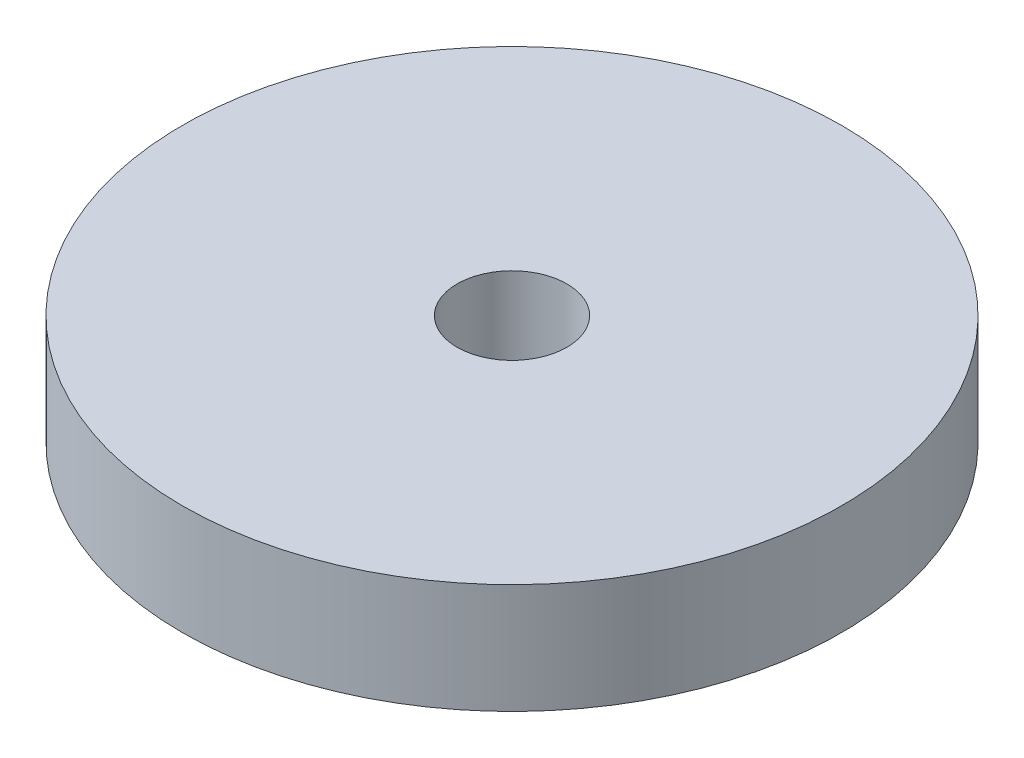
ISO-10303-21;
HEADER;
FILE_DESCRIPTION(('STEP AP214'),'2;1');
FILE_NAME('part.step','',(''),(''),'','','');
FILE_SCHEMA(('AUTOMOTIVE_DESIGN { 1 0 10303 214 1 1 1 1 }'));
ENDSEC;
DATA;
#1=APPLICATION_CONTEXT('core data for automotive mechanical design processes');
#2=APPLICATION_PROTOCOL_DEFINITION('international standard','automotive_design',2000,#1);
#3=PRODUCT_CONTEXT('',#1,'mechanical');
#4=PRODUCT('Part','Part','',(#3));
#5=PRODUCT_RELATED_PRODUCT_CATEGORY('part','',(#4));
#6=PRODUCT_DEFINITION_FORMATION('','',#4);
#7=PRODUCT_DEFINITION_CONTEXT('part definition',#1,'design');
#8=PRODUCT_DEFINITION('design','',#6,#7);
#9=PRODUCT_DEFINITION_SHAPE('','',#8);
#10=(LENGTH_UNIT() NAMED_UNIT(*) SI_UNIT(.MILLI.,.METRE.));
#11=(NAMED_UNIT(*) PLANE_ANGLE_UNIT() SI_UNIT($,.RADIAN.));
#12=(NAMED_UNIT(*) SI_UNIT($,.STERADIAN.) SOLID_ANGLE_UNIT());
#13=UNCERTAINTY_MEASURE_WITH_UNIT(LENGTH_MEASURE(1.E-05),#10,'distance_accuracy_value','');
#14=(GEOMETRIC_REPRESENTATION_CONTEXT(3) GLOBAL_UNCERTAINTY_ASSIGNED_CONTEXT((#13)) GLOBAL_UNIT_ASSIGNED_CONTEXT((#10,
#11,#12)) REPRESENTATION_CONTEXT('',''));
#15=CARTESIAN_POINT('',(0.,0.,0.));
#16=DIRECTION('',(0.,0.,1.));
#17=DIRECTION('',(1.,0.,0.));
#18=AXIS2_PLACEMENT_3D('',#15,#16,#17);
#19=CARTESIAN_POINT('',(0.,-25.,0.));
#20=DIRECTION('',(0.,1.,0.));
#21=DIRECTION('',(0.,0.,1.));
#22=AXIS2_PLACEMENT_3D('',#19,#20,#21);
#23=CYLINDRICAL_SURFACE('',#22,150.);
#24=CARTESIAN_POINT('',(0.,-25.,0.));
#25=DIRECTION('',(0.,1.,0.));
#26=DIRECTION('',(0.,0.,1.));
#27=AXIS2_PLACEMENT_3D('',#24,#25,#26);
#28=CIRCLE('',#27,150.);
#29=CARTESIAN_POINT('',(0.,-25.,150.));
#30=VERTEX_POINT('',#29);
#31=EDGE_CURVE('E10',#30,#30,#28,.T.);
#32=ORIENTED_EDGE('',*,*,#31,.T.);
#33=EDGE_LOOP('',(#32));
#34=FACE_BOUND('',#33,.T.);
#35=CARTESIAN_POINT('',(0.,25.,0.));
#36=DIRECTION('',(0.,1.,0.));
#37=DIRECTION('',(0.,0.,1.));
#38=AXIS2_PLACEMENT_3D('',#35,#36,#37);
#39=CIRCLE('',#38,150.);
#40=CARTESIAN_POINT('',(0.,25.,150.));
#41=VERTEX_POINT('',#40);
#42=EDGE_CURVE('E38',#41,#41,#39,.T.);
#43=ORIENTED_EDGE('',*,*,#42,.F.);
#44=EDGE_LOOP('',(#43));
#45=FACE_BOUND('',#44,.T.);
#46=ADVANCED_FACE('F32',(#34,#45),#23,.T.);
#47=CARTESIAN_POINT('',(0.,-25.,0.));
#48=DIRECTION('',(0.,1.,0.));
#49=DIRECTION('',(0.,0.,1.));
#50=AXIS2_PLACEMENT_3D('',#47,#48,#49);
#51=PLANE('',#50);
#52=CARTESIAN_POINT('',(0.,-25.,0.));
#53=DIRECTION('',(0.,1.,0.));
#54=DIRECTION('',(0.,0.,1.));
#55=AXIS2_PLACEMENT_3D('',#52,#53,#54);
#56=CIRCLE('',#55,25.);
#57=CARTESIAN_POINT('',(0.,-25.,25.));
#58=VERTEX_POINT('',#57);
#59=EDGE_CURVE('E42',#58,#58,#56,.T.);
#60=ORIENTED_EDGE('',*,*,#59,.T.);
#61=EDGE_LOOP('',(#60));
#62=FACE_BOUND('',#61,.T.);
#63=ORIENTED_EDGE('',*,*,#31,.F.);
#64=EDGE_LOOP('',(#63));
#65=FACE_BOUND('',#64,.T.);
#66=ADVANCED_FACE('F56',(#62,#65),#51,.F.);
#67=CARTESIAN_POINT('',(0.,25.,0.));
#68=DIRECTION('',(0.,1.,0.));
#69=DIRECTION('',(0.,0.,1.));
#70=AXIS2_PLACEMENT_3D('',#67,#68,#69);
#71=PLANE('',#70);
#72=CARTESIAN_POINT('',(0.,25.,0.));
#73=DIRECTION('',(0.,1.,0.));
#74=DIRECTION('',(0.,0.,1.));
#75=AXIS2_PLACEMENT_3D('',#72,#73,#74);
#76=CIRCLE('',#75,25.);
#77=CARTESIAN_POINT('',(0.,25.,25.));
#78=VERTEX_POINT('',#77);
#79=EDGE_CURVE('E46',#78,#78,#76,.T.);
#80=ORIENTED_EDGE('',*,*,#79,.F.);
#81=EDGE_LOOP('',(#80));
#82=FACE_BOUND('',#81,.T.);
#83=ORIENTED_EDGE('',*,*,#42,.T.);
#84=EDGE_LOOP('',(#83));
#85=FACE_BOUND('',#84,.T.);
#86=ADVANCED_FACE('F54',(#82,#85),#71,.T.);
#87=CARTESIAN_POINT('',(0.,-25.,0.));
#88=DIRECTION('',(0.,1.,0.));
#89=DIRECTION('',(0.,0.,1.));
#90=AXIS2_PLACEMENT_3D('',#87,#88,#89);
#91=CYLINDRICAL_SURFACE('',#90,25.);
#92=ORIENTED_EDGE('',*,*,#59,.F.);
#93=EDGE_LOOP('',(#92));
#94=FACE_BOUND('',#93,.T.);
#95=ORIENTED_EDGE('',*,*,#79,.T.);
#96=EDGE_LOOP('',(#95));
#97=FACE_BOUND('',#96,.T.);
#98=ADVANCED_FACE('F52',(#94,#97),#91,.F.);
#99=CLOSED_SHELL('',(#46,#66,#86,#98));
#100=MANIFOLD_SOLID_BREP('B2',#99);
#101=ADVANCED_BREP_SHAPE_REPRESENTATION('',(#18,#100),#14);
#102=SHAPE_DEFINITION_REPRESENTATION(#9,#101);
ENDSEC;
END-ISO-10303-21;
